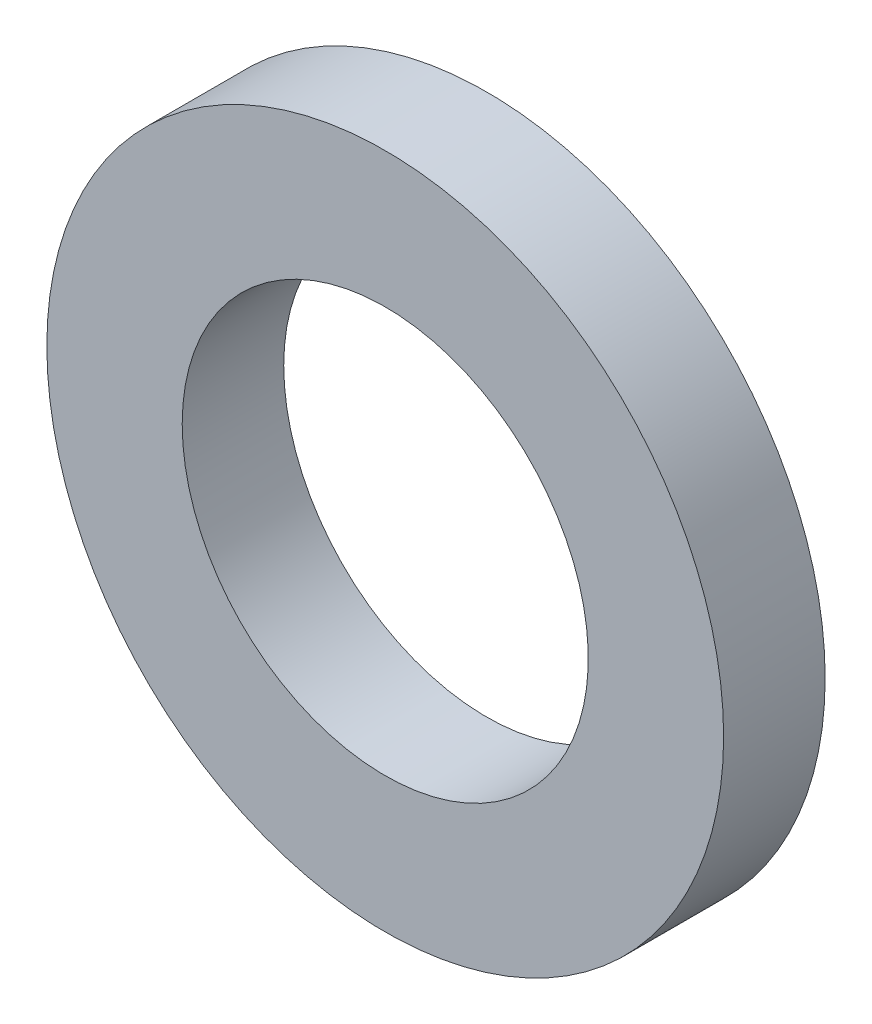
ISO-10303-21;
HEADER;
FILE_DESCRIPTION(('STEP AP214'),'2;1');
FILE_NAME('part.step','',(''),(''),'','','');
FILE_SCHEMA(('AUTOMOTIVE_DESIGN { 1 0 10303 214 1 1 1 1 }'));
ENDSEC;
DATA;
#1=APPLICATION_CONTEXT('core data for automotive mechanical design processes');
#2=APPLICATION_PROTOCOL_DEFINITION('international standard','automotive_design',2000,#1);
#3=PRODUCT_CONTEXT('',#1,'mechanical');
#4=PRODUCT('Part','Part','',(#3));
#5=PRODUCT_RELATED_PRODUCT_CATEGORY('part','',(#4));
#6=PRODUCT_DEFINITION_FORMATION('','',#4);
#7=PRODUCT_DEFINITION_CONTEXT('part definition',#1,'design');
#8=PRODUCT_DEFINITION('design','',#6,#7);
#9=PRODUCT_DEFINITION_SHAPE('','',#8);
#10=(LENGTH_UNIT() NAMED_UNIT(*) SI_UNIT(.MILLI.,.METRE.));
#11=(NAMED_UNIT(*) PLANE_ANGLE_UNIT() SI_UNIT($,.RADIAN.));
#12=(NAMED_UNIT(*) SI_UNIT($,.STERADIAN.) SOLID_ANGLE_UNIT());
#13=UNCERTAINTY_MEASURE_WITH_UNIT(LENGTH_MEASURE(1.E-05),#10,'distance_accuracy_value','');
#14=(GEOMETRIC_REPRESENTATION_CONTEXT(3) GLOBAL_UNCERTAINTY_ASSIGNED_CONTEXT((#13)) GLOBAL_UNIT_ASSIGNED_CONTEXT((#10,
#11,#12)) REPRESENTATION_CONTEXT('',''));
#15=CARTESIAN_POINT('',(0.,0.,0.));
#16=DIRECTION('',(0.,0.,1.));
#17=DIRECTION('',(1.,0.,0.));
#18=AXIS2_PLACEMENT_3D('',#15,#16,#17);
#19=CARTESIAN_POINT('',(3.,0.,0.));
#20=DIRECTION('',(0.,0.,-1.));
#21=DIRECTION('',(-1.,0.,0.));
#22=AXIS2_PLACEMENT_3D('',#19,#20,#21);
#23=PLANE('',#22);
#24=CARTESIAN_POINT('',(0.,0.,0.));
#25=DIRECTION('',(0.,0.,-1.));
#26=DIRECTION('',(-1.,0.,0.));
#27=AXIS2_PLACEMENT_3D('',#24,#25,#26);
#28=CIRCLE('',#27,3.);
#29=CARTESIAN_POINT('',(-3.,0.,0.));
#30=VERTEX_POINT('',#29);
#31=EDGE_CURVE('E18',#30,#30,#28,.T.);
#32=ORIENTED_EDGE('',*,*,#31,.T.);
#33=EDGE_LOOP('',(#32));
#34=FACE_BOUND('',#33,.T.);
#35=CARTESIAN_POINT('',(0.,0.,0.));
#36=DIRECTION('',(0.,0.,-1.));
#37=DIRECTION('',(-1.,0.,0.));
#38=AXIS2_PLACEMENT_3D('',#35,#36,#37);
#39=CIRCLE('',#38,5.00000000000001);
#40=CARTESIAN_POINT('',(-5.00000000000001,0.,0.));
#41=VERTEX_POINT('',#40);
#42=EDGE_CURVE('E27',#41,#41,#39,.T.);
#43=ORIENTED_EDGE('',*,*,#42,.F.);
#44=EDGE_LOOP('',(#43));
#45=FACE_BOUND('',#44,.T.);
#46=ADVANCED_FACE('F15',(#34,#45),#23,.F.);
#47=CARTESIAN_POINT('',(0.,0.,-50.5666886351557));
#48=DIRECTION('',(0.,0.,-1.));
#49=DIRECTION('',(-1.,0.,0.));
#50=AXIS2_PLACEMENT_3D('',#47,#48,#49);
#51=CYLINDRICAL_SURFACE('',#50,3.);
#52=ORIENTED_EDGE('',*,*,#31,.F.);
#53=EDGE_LOOP('',(#52));
#54=FACE_BOUND('',#53,.T.);
#55=CARTESIAN_POINT('',(0.,0.,-1.49999999999999));
#56=DIRECTION('',(0.,0.,-1.));
#57=DIRECTION('',(-1.,0.,0.));
#58=AXIS2_PLACEMENT_3D('',#55,#56,#57);
#59=CIRCLE('',#58,3.);
#60=CARTESIAN_POINT('',(-3.,0.,-1.49999999999999));
#61=VERTEX_POINT('',#60);
#62=EDGE_CURVE('E22',#61,#61,#59,.T.);
#63=ORIENTED_EDGE('',*,*,#62,.T.);
#64=EDGE_LOOP('',(#63));
#65=FACE_BOUND('',#64,.T.);
#66=ADVANCED_FACE('F37',(#54,#65),#51,.F.);
#67=CARTESIAN_POINT('',(0.,0.,-50.5666886351557));
#68=DIRECTION('',(0.,0.,-1.));
#69=DIRECTION('',(-1.,0.,0.));
#70=AXIS2_PLACEMENT_3D('',#67,#68,#69);
#71=CYLINDRICAL_SURFACE('',#70,5.00000000000001);
#72=CARTESIAN_POINT('',(0.,0.,-1.49999999999999));
#73=DIRECTION('',(0.,0.,-1.));
#74=DIRECTION('',(-1.,0.,0.));
#75=AXIS2_PLACEMENT_3D('',#72,#73,#74);
#76=CIRCLE('',#75,5.00000000000001);
#77=CARTESIAN_POINT('',(-5.00000000000001,0.,-1.49999999999999));
#78=VERTEX_POINT('',#77);
#79=EDGE_CURVE('E10',#78,#78,#76,.F.);
#80=ORIENTED_EDGE('',*,*,#79,.T.);
#81=EDGE_LOOP('',(#80));
#82=FACE_BOUND('',#81,.T.);
#83=ORIENTED_EDGE('',*,*,#42,.T.);
#84=EDGE_LOOP('',(#83));
#85=FACE_BOUND('',#84,.T.);
#86=ADVANCED_FACE('F40',(#82,#85),#71,.T.);
#87=CARTESIAN_POINT('',(3.00000000000001,0.,-1.49999999999999));
#88=DIRECTION('',(0.,0.,1.));
#89=DIRECTION('',(1.,0.,0.));
#90=AXIS2_PLACEMENT_3D('',#87,#88,#89);
#91=PLANE('',#90);
#92=ORIENTED_EDGE('',*,*,#79,.F.);
#93=EDGE_LOOP('',(#92));
#94=FACE_BOUND('',#93,.T.);
#95=ORIENTED_EDGE('',*,*,#62,.F.);
#96=EDGE_LOOP('',(#95));
#97=FACE_BOUND('',#96,.T.);
#98=ADVANCED_FACE('F43',(#94,#97),#91,.F.);
#99=CLOSED_SHELL('',(#46,#66,#86,#98));
#100=MANIFOLD_SOLID_BREP('B1',#99);
#101=ADVANCED_BREP_SHAPE_REPRESENTATION('',(#18,#100),#14);
#102=SHAPE_DEFINITION_REPRESENTATION(#9,#101);
ENDSEC;
END-ISO-10303-21;
